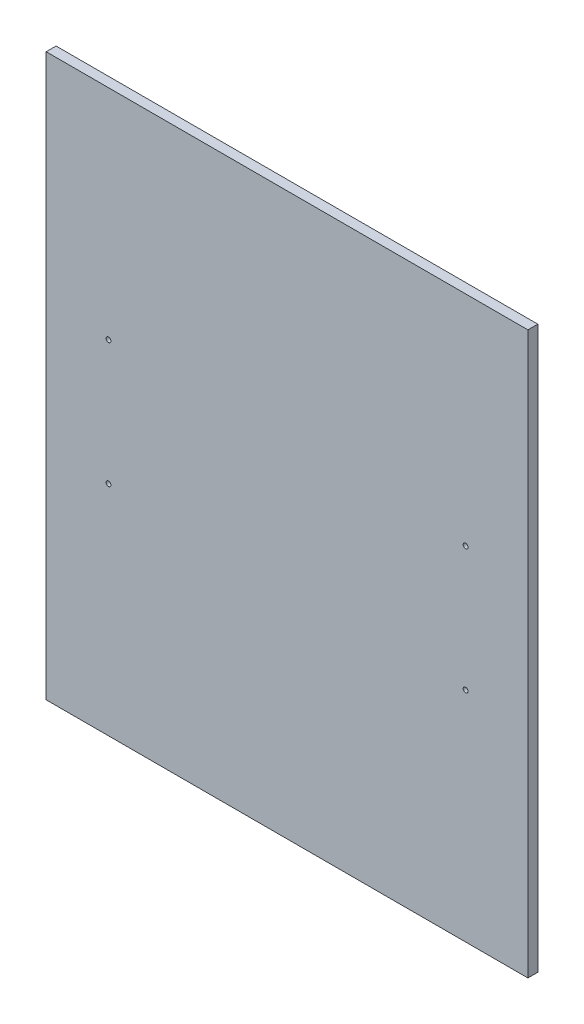
ISO-10303-21;
HEADER;
FILE_DESCRIPTION(('STEP AP214'),'2;1');
FILE_NAME('part.step','',(''),(''),'','','');
FILE_SCHEMA(('AUTOMOTIVE_DESIGN { 1 0 10303 214 1 1 1 1 }'));
ENDSEC;
DATA;
#1=APPLICATION_CONTEXT('core data for automotive mechanical design processes');
#2=APPLICATION_PROTOCOL_DEFINITION('international standard','automotive_design',2000,#1);
#3=PRODUCT_CONTEXT('',#1,'mechanical');
#4=PRODUCT('Part','Part','',(#3));
#5=PRODUCT_RELATED_PRODUCT_CATEGORY('part','',(#4));
#6=PRODUCT_DEFINITION_FORMATION('','',#4);
#7=PRODUCT_DEFINITION_CONTEXT('part definition',#1,'design');
#8=PRODUCT_DEFINITION('design','',#6,#7);
#9=PRODUCT_DEFINITION_SHAPE('','',#8);
#10=(LENGTH_UNIT() NAMED_UNIT(*) SI_UNIT(.MILLI.,.METRE.));
#11=(NAMED_UNIT(*) PLANE_ANGLE_UNIT() SI_UNIT($,.RADIAN.));
#12=(NAMED_UNIT(*) SI_UNIT($,.STERADIAN.) SOLID_ANGLE_UNIT());
#13=UNCERTAINTY_MEASURE_WITH_UNIT(LENGTH_MEASURE(1.E-05),#10,'distance_accuracy_value','');
#14=(GEOMETRIC_REPRESENTATION_CONTEXT(3) GLOBAL_UNCERTAINTY_ASSIGNED_CONTEXT((#13)) GLOBAL_UNIT_ASSIGNED_CONTEXT((#10,
#11,#12)) REPRESENTATION_CONTEXT('',''));
#15=CARTESIAN_POINT('',(0.,0.,0.));
#16=DIRECTION('',(0.,0.,1.));
#17=DIRECTION('',(1.,0.,0.));
#18=AXIS2_PLACEMENT_3D('',#15,#16,#17);
#19=CARTESIAN_POINT('',(0.,0.,6.35));
#20=DIRECTION('',(0.,0.,-1.));
#21=DIRECTION('',(-1.,0.,0.));
#22=AXIS2_PLACEMENT_3D('',#19,#20,#21);
#23=PLANE('',#22);
#24=DIRECTION('',(0.,-1.,0.));
#25=VECTOR('',#24,1.);
#26=CARTESIAN_POINT('',(0.,0.,6.35));
#27=LINE('',#26,#25);
#28=CARTESIAN_POINT('',(0.,360.,6.35));
#29=VERTEX_POINT('',#28);
#30=CARTESIAN_POINT('',(0.,0.,6.35));
#31=VERTEX_POINT('',#30);
#32=EDGE_CURVE('E92',#29,#31,#27,.T.);
#33=ORIENTED_EDGE('',*,*,#32,.T.);
#34=DIRECTION('',(1.,0.,0.));
#35=VECTOR('',#34,1.);
#36=CARTESIAN_POINT('',(0.,0.,6.35));
#37=LINE('',#36,#35);
#38=CARTESIAN_POINT('',(309.,0.,6.35));
#39=VERTEX_POINT('',#38);
#40=EDGE_CURVE('E87',#31,#39,#37,.T.);
#41=ORIENTED_EDGE('',*,*,#40,.T.);
#42=DIRECTION('',(0.,1.,0.));
#43=VECTOR('',#42,1.);
#44=CARTESIAN_POINT('',(309.,0.,6.35));
#45=LINE('',#44,#43);
#46=CARTESIAN_POINT('',(309.,360.,6.35));
#47=VERTEX_POINT('',#46);
#48=EDGE_CURVE('E90',#39,#47,#45,.T.);
#49=ORIENTED_EDGE('',*,*,#48,.T.);
#50=DIRECTION('',(-1.,0.,0.));
#51=VECTOR('',#50,1.);
#52=CARTESIAN_POINT('',(0.,360.,6.35));
#53=LINE('',#52,#51);
#54=EDGE_CURVE('E57',#47,#29,#53,.T.);
#55=ORIENTED_EDGE('',*,*,#54,.T.);
#56=EDGE_LOOP('',(#33,#41,#49,#55));
#57=FACE_BOUND('',#56,.T.);
#58=CARTESIAN_POINT('',(40.,220.,6.35));
#59=DIRECTION('',(0.,0.,1.));
#60=DIRECTION('',(1.,0.,0.));
#61=AXIS2_PLACEMENT_3D('',#58,#59,#60);
#62=CIRCLE('',#61,1.54999999999999);
#63=CARTESIAN_POINT('',(41.55,220.,6.35));
#64=VERTEX_POINT('',#63);
#65=EDGE_CURVE('E112',#64,#64,#62,.T.);
#66=ORIENTED_EDGE('',*,*,#65,.F.);
#67=EDGE_LOOP('',(#66));
#68=FACE_BOUND('',#67,.T.);
#69=CARTESIAN_POINT('',(40.,140.,6.35));
#70=DIRECTION('',(0.,0.,1.));
#71=DIRECTION('',(-1.,0.,0.));
#72=AXIS2_PLACEMENT_3D('',#69,#70,#71);
#73=CIRCLE('',#72,1.54999999999998);
#74=CARTESIAN_POINT('',(38.45,140.,6.35));
#75=VERTEX_POINT('',#74);
#76=EDGE_CURVE('E134',#75,#75,#73,.T.);
#77=ORIENTED_EDGE('',*,*,#76,.F.);
#78=EDGE_LOOP('',(#77));
#79=FACE_BOUND('',#78,.T.);
#80=CARTESIAN_POINT('',(269.,140.,6.35));
#81=DIRECTION('',(0.,0.,1.));
#82=DIRECTION('',(1.,0.,0.));
#83=AXIS2_PLACEMENT_3D('',#80,#81,#82);
#84=CIRCLE('',#83,1.54999999999998);
#85=CARTESIAN_POINT('',(270.55,140.,6.35));
#86=VERTEX_POINT('',#85);
#87=EDGE_CURVE('E142',#86,#86,#84,.T.);
#88=ORIENTED_EDGE('',*,*,#87,.F.);
#89=EDGE_LOOP('',(#88));
#90=FACE_BOUND('',#89,.T.);
#91=CARTESIAN_POINT('',(269.,220.,6.35));
#92=DIRECTION('',(0.,0.,1.));
#93=DIRECTION('',(-1.,0.,0.));
#94=AXIS2_PLACEMENT_3D('',#91,#92,#93);
#95=CIRCLE('',#94,1.54999999999999);
#96=CARTESIAN_POINT('',(267.45,220.,6.35));
#97=VERTEX_POINT('',#96);
#98=EDGE_CURVE('E150',#97,#97,#95,.T.);
#99=ORIENTED_EDGE('',*,*,#98,.F.);
#100=EDGE_LOOP('',(#99));
#101=FACE_BOUND('',#100,.T.);
#102=ADVANCED_FACE('F39',(#57,#68,#79,#90,#101),#23,.F.);
#103=CARTESIAN_POINT('',(0.,0.,0.));
#104=DIRECTION('',(0.,0.,-1.));
#105=DIRECTION('',(-1.,0.,0.));
#106=AXIS2_PLACEMENT_3D('',#103,#104,#105);
#107=PLANE('',#106);
#108=CARTESIAN_POINT('',(269.,140.,0.));
#109=DIRECTION('',(0.,0.,1.));
#110=DIRECTION('',(1.,0.,0.));
#111=AXIS2_PLACEMENT_3D('',#108,#109,#110);
#112=CIRCLE('',#111,1.54999999999998);
#113=CARTESIAN_POINT('',(270.55,140.,0.));
#114=VERTEX_POINT('',#113);
#115=EDGE_CURVE('E146',#114,#114,#112,.T.);
#116=ORIENTED_EDGE('',*,*,#115,.T.);
#117=EDGE_LOOP('',(#116));
#118=FACE_BOUND('',#117,.T.);
#119=CARTESIAN_POINT('',(40.,220.,0.));
#120=DIRECTION('',(0.,0.,1.));
#121=DIRECTION('',(1.,0.,0.));
#122=AXIS2_PLACEMENT_3D('',#119,#120,#121);
#123=CIRCLE('',#122,1.54999999999999);
#124=CARTESIAN_POINT('',(41.55,220.,0.));
#125=VERTEX_POINT('',#124);
#126=EDGE_CURVE('E130',#125,#125,#123,.T.);
#127=ORIENTED_EDGE('',*,*,#126,.T.);
#128=EDGE_LOOP('',(#127));
#129=FACE_BOUND('',#128,.T.);
#130=DIRECTION('',(0.,-1.,0.));
#131=VECTOR('',#130,1.);
#132=CARTESIAN_POINT('',(0.,0.,0.));
#133=LINE('',#132,#131);
#134=CARTESIAN_POINT('',(0.,360.,0.));
#135=VERTEX_POINT('',#134);
#136=CARTESIAN_POINT('',(0.,0.,0.));
#137=VERTEX_POINT('',#136);
#138=EDGE_CURVE('E108',#135,#137,#133,.T.);
#139=ORIENTED_EDGE('',*,*,#138,.F.);
#140=DIRECTION('',(-1.,0.,0.));
#141=VECTOR('',#140,1.);
#142=CARTESIAN_POINT('',(0.,360.,0.));
#143=LINE('',#142,#141);
#144=CARTESIAN_POINT('',(309.,360.,0.));
#145=VERTEX_POINT('',#144);
#146=EDGE_CURVE('E80',#145,#135,#143,.T.);
#147=ORIENTED_EDGE('',*,*,#146,.F.);
#148=DIRECTION('',(0.,1.,0.));
#149=VECTOR('',#148,1.);
#150=CARTESIAN_POINT('',(309.,0.,0.));
#151=LINE('',#150,#149);
#152=CARTESIAN_POINT('',(309.,0.,0.));
#153=VERTEX_POINT('',#152);
#154=EDGE_CURVE('E74',#153,#145,#151,.T.);
#155=ORIENTED_EDGE('',*,*,#154,.F.);
#156=DIRECTION('',(1.,0.,0.));
#157=VECTOR('',#156,1.);
#158=CARTESIAN_POINT('',(0.,0.,0.));
#159=LINE('',#158,#157);
#160=EDGE_CURVE('E97',#137,#153,#159,.T.);
#161=ORIENTED_EDGE('',*,*,#160,.F.);
#162=EDGE_LOOP('',(#139,#147,#155,#161));
#163=FACE_BOUND('',#162,.T.);
#164=CARTESIAN_POINT('',(40.,140.,0.));
#165=DIRECTION('',(0.,0.,1.));
#166=DIRECTION('',(-1.,0.,0.));
#167=AXIS2_PLACEMENT_3D('',#164,#165,#166);
#168=CIRCLE('',#167,1.54999999999998);
#169=CARTESIAN_POINT('',(38.45,140.,0.));
#170=VERTEX_POINT('',#169);
#171=EDGE_CURVE('E138',#170,#170,#168,.T.);
#172=ORIENTED_EDGE('',*,*,#171,.T.);
#173=EDGE_LOOP('',(#172));
#174=FACE_BOUND('',#173,.T.);
#175=CARTESIAN_POINT('',(269.,220.,0.));
#176=DIRECTION('',(0.,0.,1.));
#177=DIRECTION('',(-1.,0.,0.));
#178=AXIS2_PLACEMENT_3D('',#175,#176,#177);
#179=CIRCLE('',#178,1.54999999999999);
#180=CARTESIAN_POINT('',(267.45,220.,0.));
#181=VERTEX_POINT('',#180);
#182=EDGE_CURVE('E154',#181,#181,#179,.T.);
#183=ORIENTED_EDGE('',*,*,#182,.T.);
#184=EDGE_LOOP('',(#183));
#185=FACE_BOUND('',#184,.T.);
#186=ADVANCED_FACE('F125',(#118,#129,#163,#174,#185),#107,.T.);
#187=CARTESIAN_POINT('',(0.,0.,6.35));
#188=DIRECTION('',(1.,0.,0.));
#189=DIRECTION('',(0.,0.,-1.));
#190=AXIS2_PLACEMENT_3D('',#187,#188,#189);
#191=PLANE('',#190);
#192=ORIENTED_EDGE('',*,*,#138,.T.);
#193=DIRECTION('',(0.,0.,-1.));
#194=VECTOR('',#193,1.);
#195=CARTESIAN_POINT('',(0.,0.,6.35));
#196=LINE('',#195,#194);
#197=EDGE_CURVE('E11',#31,#137,#196,.T.);
#198=ORIENTED_EDGE('',*,*,#197,.F.);
#199=ORIENTED_EDGE('',*,*,#32,.F.);
#200=DIRECTION('',(0.,0.,-1.));
#201=VECTOR('',#200,1.);
#202=CARTESIAN_POINT('',(0.,360.,6.35));
#203=LINE('',#202,#201);
#204=EDGE_CURVE('E104',#29,#135,#203,.T.);
#205=ORIENTED_EDGE('',*,*,#204,.T.);
#206=EDGE_LOOP('',(#192,#198,#199,#205));
#207=FACE_BOUND('',#206,.T.);
#208=ADVANCED_FACE('F41',(#207),#191,.F.);
#209=CARTESIAN_POINT('',(0.,0.,6.35));
#210=DIRECTION('',(0.,1.,0.));
#211=DIRECTION('',(0.,0.,1.));
#212=AXIS2_PLACEMENT_3D('',#209,#210,#211);
#213=PLANE('',#212);
#214=ORIENTED_EDGE('',*,*,#160,.T.);
#215=DIRECTION('',(0.,0.,-1.));
#216=VECTOR('',#215,1.);
#217=CARTESIAN_POINT('',(309.,0.,6.35));
#218=LINE('',#217,#216);
#219=EDGE_CURVE('E49',#39,#153,#218,.T.);
#220=ORIENTED_EDGE('',*,*,#219,.F.);
#221=ORIENTED_EDGE('',*,*,#40,.F.);
#222=ORIENTED_EDGE('',*,*,#197,.T.);
#223=EDGE_LOOP('',(#214,#220,#221,#222));
#224=FACE_BOUND('',#223,.T.);
#225=ADVANCED_FACE('F96',(#224),#213,.F.);
#226=CARTESIAN_POINT('',(309.,0.,6.35));
#227=DIRECTION('',(-1.,0.,0.));
#228=DIRECTION('',(0.,0.,1.));
#229=AXIS2_PLACEMENT_3D('',#226,#227,#228);
#230=PLANE('',#229);
#231=ORIENTED_EDGE('',*,*,#154,.T.);
#232=DIRECTION('',(0.,0.,-1.));
#233=VECTOR('',#232,1.);
#234=CARTESIAN_POINT('',(309.,360.,6.35));
#235=LINE('',#234,#233);
#236=EDGE_CURVE('E99',#47,#145,#235,.T.);
#237=ORIENTED_EDGE('',*,*,#236,.F.);
#238=ORIENTED_EDGE('',*,*,#48,.F.);
#239=ORIENTED_EDGE('',*,*,#219,.T.);
#240=EDGE_LOOP('',(#231,#237,#238,#239));
#241=FACE_BOUND('',#240,.T.);
#242=ADVANCED_FACE('F100',(#241),#230,.F.);
#243=CARTESIAN_POINT('',(0.,360.,6.35));
#244=DIRECTION('',(0.,-1.,0.));
#245=DIRECTION('',(1.,0.,0.));
#246=AXIS2_PLACEMENT_3D('',#243,#244,#245);
#247=PLANE('',#246);
#248=ORIENTED_EDGE('',*,*,#146,.T.);
#249=ORIENTED_EDGE('',*,*,#204,.F.);
#250=ORIENTED_EDGE('',*,*,#54,.F.);
#251=ORIENTED_EDGE('',*,*,#236,.T.);
#252=EDGE_LOOP('',(#248,#249,#250,#251));
#253=FACE_BOUND('',#252,.T.);
#254=ADVANCED_FACE('F122',(#253),#247,.F.);
#255=CARTESIAN_POINT('',(40.,220.,6.35));
#256=DIRECTION('',(0.,0.,-1.));
#257=DIRECTION('',(-1.,0.,0.));
#258=AXIS2_PLACEMENT_3D('',#255,#256,#257);
#259=CYLINDRICAL_SURFACE('',#258,1.54999999999999);
#260=ORIENTED_EDGE('',*,*,#65,.T.);
#261=EDGE_LOOP('',(#260));
#262=FACE_BOUND('',#261,.T.);
#263=ORIENTED_EDGE('',*,*,#126,.F.);
#264=EDGE_LOOP('',(#263));
#265=FACE_BOUND('',#264,.T.);
#266=ADVANCED_FACE('F173',(#262,#265),#259,.F.);
#267=CARTESIAN_POINT('',(40.,140.,6.35));
#268=DIRECTION('',(0.,0.,-1.));
#269=DIRECTION('',(-1.,0.,0.));
#270=AXIS2_PLACEMENT_3D('',#267,#268,#269);
#271=CYLINDRICAL_SURFACE('',#270,1.54999999999998);
#272=ORIENTED_EDGE('',*,*,#76,.T.);
#273=EDGE_LOOP('',(#272));
#274=FACE_BOUND('',#273,.T.);
#275=ORIENTED_EDGE('',*,*,#171,.F.);
#276=EDGE_LOOP('',(#275));
#277=FACE_BOUND('',#276,.T.);
#278=ADVANCED_FACE('F219',(#274,#277),#271,.F.);
#279=CARTESIAN_POINT('',(269.,140.,6.35));
#280=DIRECTION('',(0.,0.,-1.));
#281=DIRECTION('',(-1.,0.,0.));
#282=AXIS2_PLACEMENT_3D('',#279,#280,#281);
#283=CYLINDRICAL_SURFACE('',#282,1.54999999999998);
#284=ORIENTED_EDGE('',*,*,#87,.T.);
#285=EDGE_LOOP('',(#284));
#286=FACE_BOUND('',#285,.T.);
#287=ORIENTED_EDGE('',*,*,#115,.F.);
#288=EDGE_LOOP('',(#287));
#289=FACE_BOUND('',#288,.T.);
#290=ADVANCED_FACE('F227',(#286,#289),#283,.F.);
#291=CARTESIAN_POINT('',(269.,220.,6.35));
#292=DIRECTION('',(0.,0.,-1.));
#293=DIRECTION('',(-1.,0.,0.));
#294=AXIS2_PLACEMENT_3D('',#291,#292,#293);
#295=CYLINDRICAL_SURFACE('',#294,1.54999999999999);
#296=ORIENTED_EDGE('',*,*,#98,.T.);
#297=EDGE_LOOP('',(#296));
#298=FACE_BOUND('',#297,.T.);
#299=ORIENTED_EDGE('',*,*,#182,.F.);
#300=EDGE_LOOP('',(#299));
#301=FACE_BOUND('',#300,.T.);
#302=ADVANCED_FACE('F162',(#298,#301),#295,.F.);
#303=CLOSED_SHELL('',(#102,#186,#208,#225,#242,#254,#266,#278,#290,#302));
#304=MANIFOLD_SOLID_BREP('B2',#303);
#305=ADVANCED_BREP_SHAPE_REPRESENTATION('',(#18,#304),#14);
#306=SHAPE_DEFINITION_REPRESENTATION(#9,#305);
ENDSEC;
END-ISO-10303-21;
